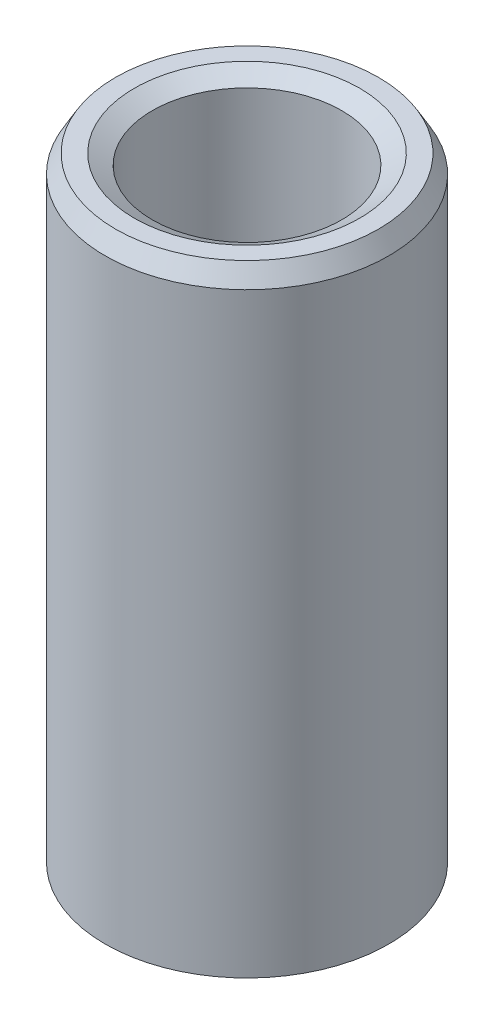
ISO-10303-21;
HEADER;
FILE_DESCRIPTION(('STEP AP214'),'2;1');
FILE_NAME('part.step','',(''),(''),'','','');
FILE_SCHEMA(('AUTOMOTIVE_DESIGN { 1 0 10303 214 1 1 1 1 }'));
ENDSEC;
DATA;
#1=APPLICATION_CONTEXT('core data for automotive mechanical design processes');
#2=APPLICATION_PROTOCOL_DEFINITION('international standard','automotive_design',2000,#1);
#3=PRODUCT_CONTEXT('',#1,'mechanical');
#4=PRODUCT('Part','Part','',(#3));
#5=PRODUCT_RELATED_PRODUCT_CATEGORY('part','',(#4));
#6=PRODUCT_DEFINITION_FORMATION('','',#4);
#7=PRODUCT_DEFINITION_CONTEXT('part definition',#1,'design');
#8=PRODUCT_DEFINITION('design','',#6,#7);
#9=PRODUCT_DEFINITION_SHAPE('','',#8);
#10=(LENGTH_UNIT() NAMED_UNIT(*) SI_UNIT(.MILLI.,.METRE.));
#11=(NAMED_UNIT(*) PLANE_ANGLE_UNIT() SI_UNIT($,.RADIAN.));
#12=(NAMED_UNIT(*) SI_UNIT($,.STERADIAN.) SOLID_ANGLE_UNIT());
#13=UNCERTAINTY_MEASURE_WITH_UNIT(LENGTH_MEASURE(1.E-05),#10,'distance_accuracy_value','');
#14=(GEOMETRIC_REPRESENTATION_CONTEXT(3) GLOBAL_UNCERTAINTY_ASSIGNED_CONTEXT((#13)) GLOBAL_UNIT_ASSIGNED_CONTEXT((#10,
#11,#12)) REPRESENTATION_CONTEXT('',''));
#15=CARTESIAN_POINT('',(0.,0.,0.));
#16=DIRECTION('',(0.,0.,1.));
#17=DIRECTION('',(1.,0.,0.));
#18=AXIS2_PLACEMENT_3D('',#15,#16,#17);
#19=CARTESIAN_POINT('',(0.,121.051964790305,0.));
#20=DIRECTION('',(0.,-1.,0.));
#21=DIRECTION('',(0.,0.,-1.));
#22=AXIS2_PLACEMENT_3D('',#19,#20,#21);
#23=CYLINDRICAL_SURFACE('',#22,27.5);
#24=CARTESIAN_POINT('',(0.,2.00933754043468,0.));
#25=DIRECTION('',(0.,1.,0.));
#26=DIRECTION('',(0.,0.,1.));
#27=AXIS2_PLACEMENT_3D('',#24,#25,#26);
#28=CIRCLE('',#27,27.5);
#29=CARTESIAN_POINT('',(0.,2.00933754043468,-27.5));
#30=VERTEX_POINT('',#29);
#31=EDGE_CURVE('E10',#30,#30,#28,.T.);
#32=CARTESIAN_POINT('',(0.,117.571690080717,0.));
#33=DIRECTION('',(0.,1.,0.));
#34=DIRECTION('',(0.,0.,1.));
#35=AXIS2_PLACEMENT_3D('',#32,#33,#34);
#36=CIRCLE('',#35,27.5);
#37=CARTESIAN_POINT('',(0.,117.571690080717,-27.5));
#38=VERTEX_POINT('',#37);
#39=EDGE_CURVE('E50',#38,#38,#36,.F.);
#40=CARTESIAN_POINT('',(0.,2.00933754043468,-27.5));
#41=CARTESIAN_POINT('',(0.,3.21311204606262,-27.5));
#42=CARTESIAN_POINT('',(0.,4.41688655169056,-27.5));
#43=CARTESIAN_POINT('',(0.,6.82443556294643,-27.5));
#44=CARTESIAN_POINT('',(0.,8.02821006857437,-27.5));
#45=CARTESIAN_POINT('',(0.,10.4357590798302,-27.5));
#46=CARTESIAN_POINT('',(0.,11.6395335854582,-27.5));
#47=CARTESIAN_POINT('',(0.,14.0470825967141,-27.5));
#48=CARTESIAN_POINT('',(0.,15.250857102342,-27.5));
#49=CARTESIAN_POINT('',(0.,17.6584061135979,-27.5));
#50=CARTESIAN_POINT('',(0.,18.8621806192258,-27.5));
#51=CARTESIAN_POINT('',(0.,21.2697296304817,-27.5));
#52=CARTESIAN_POINT('',(0.,22.4735041361096,-27.5));
#53=CARTESIAN_POINT('',(0.,24.8810531473655,-27.5));
#54=CARTESIAN_POINT('',(0.,26.0848276529934,-27.5));
#55=CARTESIAN_POINT('',(0.,28.4923766642493,-27.5));
#56=CARTESIAN_POINT('',(0.,29.6961511698773,-27.5));
#57=CARTESIAN_POINT('',(0.,32.1037001811331,-27.5));
#58=CARTESIAN_POINT('',(0.,33.3074746867611,-27.5));
#59=CARTESIAN_POINT('',(0.,35.715023698017,-27.5));
#60=CARTESIAN_POINT('',(0.,36.9187982036449,-27.5));
#61=CARTESIAN_POINT('',(0.,39.3263472149008,-27.5));
#62=CARTESIAN_POINT('',(0.,40.5301217205287,-27.5));
#63=CARTESIAN_POINT('',(0.,42.9376707317846,-27.5));
#64=CARTESIAN_POINT('',(0.,44.1414452374125,-27.5));
#65=CARTESIAN_POINT('',(0.,46.5489942486684,-27.5));
#66=CARTESIAN_POINT('',(0.,47.7527687542963,-27.5));
#67=CARTESIAN_POINT('',(0.,50.1603177655522,-27.5));
#68=CARTESIAN_POINT('',(0.,51.3640922711802,-27.5));
#69=CARTESIAN_POINT('',(0.,53.771641282436,-27.5));
#70=CARTESIAN_POINT('',(0.,54.975415788064,-27.5));
#71=CARTESIAN_POINT('',(0.,57.3829647993198,-27.5));
#72=CARTESIAN_POINT('',(0.,58.5867393049478,-27.5));
#73=CARTESIAN_POINT('',(0.,60.9942883162036,-27.5));
#74=CARTESIAN_POINT('',(0.,62.1980628218316,-27.5));
#75=CARTESIAN_POINT('',(0.,64.6056118330875,-27.5));
#76=CARTESIAN_POINT('',(0.,65.8093863387154,-27.5));
#77=CARTESIAN_POINT('',(0.,68.2169353499713,-27.5));
#78=CARTESIAN_POINT('',(0.,69.4207098555992,-27.5));
#79=CARTESIAN_POINT('',(0.,71.8282588668551,-27.5));
#80=CARTESIAN_POINT('',(0.,73.032033372483,-27.5));
#81=CARTESIAN_POINT('',(0.,75.4395823837389,-27.5));
#82=CARTESIAN_POINT('',(0.,76.6433568893668,-27.5));
#83=CARTESIAN_POINT('',(0.,79.0509059006227,-27.5));
#84=CARTESIAN_POINT('',(0.,80.2546804062507,-27.5));
#85=CARTESIAN_POINT('',(0.,82.6622294175065,-27.5));
#86=CARTESIAN_POINT('',(0.,83.8660039231345,-27.5));
#87=CARTESIAN_POINT('',(0.,86.2735529343903,-27.5));
#88=CARTESIAN_POINT('',(0.,87.4773274400183,-27.5));
#89=CARTESIAN_POINT('',(0.,89.8848764512742,-27.5));
#90=CARTESIAN_POINT('',(0.,91.0886509569021,-27.5));
#91=CARTESIAN_POINT('',(0.,93.496199968158,-27.5));
#92=CARTESIAN_POINT('',(0.,94.6999744737859,-27.5));
#93=CARTESIAN_POINT('',(0.,97.1075234850418,-27.5));
#94=CARTESIAN_POINT('',(0.,98.3112979906697,-27.5));
#95=CARTESIAN_POINT('',(0.,100.718847001926,-27.5));
#96=CARTESIAN_POINT('',(0.,101.922621507554,-27.5));
#97=CARTESIAN_POINT('',(0.,104.330170518809,-27.5));
#98=CARTESIAN_POINT('',(0.,105.533945024437,-27.5));
#99=CARTESIAN_POINT('',(0.,107.941494035693,-27.5));
#100=CARTESIAN_POINT('',(0.,109.145268541321,-27.5));
#101=CARTESIAN_POINT('',(0.,111.552817552577,-27.5));
#102=CARTESIAN_POINT('',(0.,112.756592058205,-27.5));
#103=CARTESIAN_POINT('',(0.,115.164141069461,-27.5));
#104=CARTESIAN_POINT('',(0.,116.367915575089,-27.5));
#105=CARTESIAN_POINT('',(0.,117.571690080717,-27.5));
#106=B_SPLINE_CURVE_WITH_KNOTS('',3,(#40,#41,#42,#43,#44,#45,#46,#47,#48,#49,#50,#51,#52,#53,
#54,#55,#56,#57,#58,#59,#60,#61,#62,#63,#64,#65,#66,#67,#68,#69,#70,#71,#72,#73,#74,#75,#76,#77,
#78,#79,#80,#81,#82,#83,#84,#85,#86,#87,#88,#89,#90,#91,#92,#93,#94,#95,#96,#97,#98,#99,#100,
#101,#102,#103,#104,#105),.UNSPECIFIED.,.F.,.F.,(4,2,2,2,2,2,2,2,2,2,2,2,2,2,2,2,2,2,2,2,2,2,2,
2,2,2,2,2,2,2,2,2,4),(0.,3.61132351688381,7.22264703376763,10.8339705506514,14.4452940675353,
18.0566175844191,21.6679411013029,25.2792646181867,28.8905881350705,32.5019116519543,
36.1132351688381,39.724558685722,43.3358822026058,46.9472057194896,50.5585292363734,
54.1698527532572,57.781176270141,61.3924997870248,65.0038233039086,68.6151468207925,
72.2264703376763,75.8377938545601,79.4491173714439,83.0604408883277,86.6717644052115,
90.2830879220953,93.8944114389792,97.505734955863,101.117058472747,104.728381989631,
108.339705506514,111.951029023398,115.562352540282),.UNSPECIFIED.);
#107=EDGE_CURVE('BSEAM39',#30,#38,#106,.T.);
#108=ORIENTED_EDGE('',*,*,#31,.T.);
#109=ORIENTED_EDGE('',*,*,#39,.T.);
#110=ORIENTED_EDGE('',*,*,#107,.T.);
#111=ORIENTED_EDGE('',*,*,#107,.F.);
#112=EDGE_LOOP('',(#108,#110,#109,#111));
#113=FACE_BOUND('',#112,.T.);
#114=ADVANCED_FACE('F39',(#113),#23,.T.);
#115=CARTESIAN_POINT('',(0.,121.051964790305,0.));
#116=DIRECTION('',(0.,1.,0.));
#117=DIRECTION('',(0.,0.,1.));
#118=AXIS2_PLACEMENT_3D('',#115,#116,#117);
#119=PLANE('',#118);
#120=CARTESIAN_POINT('',(0.,121.051964790305,0.));
#121=DIRECTION('',(0.,1.,0.));
#122=DIRECTION('',(0.,0.,1.));
#123=AXIS2_PLACEMENT_3D('',#120,#121,#122);
#124=CIRCLE('',#123,21.8428901434099);
#125=CARTESIAN_POINT('',(0.,121.051964790305,21.8428901434099));
#126=VERTEX_POINT('',#125);
#127=EDGE_CURVE('E58',#126,#126,#124,.F.);
#128=ORIENTED_EDGE('',*,*,#127,.T.);
#129=EDGE_LOOP('',(#128));
#130=FACE_BOUND('',#129,.T.);
#131=CARTESIAN_POINT('',(0.,121.051964790305,0.));
#132=DIRECTION('',(0.,1.,0.));
#133=DIRECTION('',(0.,0.,1.));
#134=AXIS2_PLACEMENT_3D('',#131,#132,#133);
#135=CIRCLE('',#134,25.4906624595654);
#136=CARTESIAN_POINT('',(0.,121.051964790305,25.4906624595654));
#137=VERTEX_POINT('',#136);
#138=EDGE_CURVE('E61',#137,#137,#135,.T.);
#139=ORIENTED_EDGE('',*,*,#138,.T.);
#140=EDGE_LOOP('',(#139));
#141=FACE_BOUND('',#140,.T.);
#142=ADVANCED_FACE('F88',(#130,#141),#119,.T.);
#143=CARTESIAN_POINT('',(0.,0.,0.));
#144=DIRECTION('',(0.,1.,0.));
#145=DIRECTION('',(0.,0.,1.));
#146=AXIS2_PLACEMENT_3D('',#143,#144,#145);
#147=PLANE('',#146);
#148=CARTESIAN_POINT('',(0.,0.,0.));
#149=DIRECTION('',(0.,1.,0.));
#150=DIRECTION('',(0.,0.,1.));
#151=AXIS2_PLACEMENT_3D('',#148,#149,#150);
#152=CIRCLE('',#151,20.3719529742561);
#153=CARTESIAN_POINT('',(0.,0.,20.3719529742561));
#154=VERTEX_POINT('',#153);
#155=EDGE_CURVE('E51',#154,#154,#152,.T.);
#156=ORIENTED_EDGE('',*,*,#155,.T.);
#157=EDGE_LOOP('',(#156));
#158=FACE_BOUND('',#157,.T.);
#159=CARTESIAN_POINT('',(0.,0.,0.));
#160=DIRECTION('',(0.,1.,0.));
#161=DIRECTION('',(0.,0.,1.));
#162=AXIS2_PLACEMENT_3D('',#159,#160,#161);
#163=CIRCLE('',#162,24.0197252904116);
#164=CARTESIAN_POINT('',(0.,0.,24.0197252904116));
#165=VERTEX_POINT('',#164);
#166=EDGE_CURVE('E54',#165,#165,#163,.F.);
#167=ORIENTED_EDGE('',*,*,#166,.T.);
#168=EDGE_LOOP('',(#167));
#169=FACE_BOUND('',#168,.T.);
#170=ADVANCED_FACE('F83',(#158,#169),#147,.F.);
#171=CARTESIAN_POINT('',(0.,121.051964790305,0.));
#172=DIRECTION('',(0.,-1.,0.));
#173=DIRECTION('',(0.,0.,-1.));
#174=AXIS2_PLACEMENT_3D('',#171,#172,#173);
#175=CYLINDRICAL_SURFACE('',#174,18.3626154338215);
#176=CARTESIAN_POINT('',(0.,119.04262724987,0.));
#177=DIRECTION('',(0.,1.,0.));
#178=DIRECTION('',(0.,0.,1.));
#179=AXIS2_PLACEMENT_3D('',#176,#177,#178);
#180=CIRCLE('',#179,18.3626154338215);
#181=CARTESIAN_POINT('',(0.,119.04262724987,-18.3626154338215));
#182=VERTEX_POINT('',#181);
#183=EDGE_CURVE('E67',#182,#182,#180,.T.);
#184=CARTESIAN_POINT('',(0.,3.48027470958831,0.));
#185=DIRECTION('',(0.,1.,0.));
#186=DIRECTION('',(0.,0.,1.));
#187=AXIS2_PLACEMENT_3D('',#184,#185,#186);
#188=CIRCLE('',#187,18.3626154338215);
#189=CARTESIAN_POINT('',(0.,3.4802747095883,-18.3626154338215));
#190=VERTEX_POINT('',#189);
#191=EDGE_CURVE('E69',#190,#190,#188,.F.);
#192=CARTESIAN_POINT('',(0.,119.04262724987,-18.3626154338215));
#193=CARTESIAN_POINT('',(0.,117.838852744242,-18.3626154338215));
#194=CARTESIAN_POINT('',(0.,116.635078238614,-18.3626154338215));
#195=CARTESIAN_POINT('',(0.,114.227529227359,-18.3626154338215));
#196=CARTESIAN_POINT('',(0.,113.023754721731,-18.3626154338215));
#197=CARTESIAN_POINT('',(0.,110.616205710475,-18.3626154338215));
#198=CARTESIAN_POINT('',(0.,109.412431204847,-18.3626154338215));
#199=CARTESIAN_POINT('',(0.,107.004882193591,-18.3626154338215));
#200=CARTESIAN_POINT('',(0.,105.801107687963,-18.3626154338215));
#201=CARTESIAN_POINT('',(0.,103.393558676707,-18.3626154338215));
#202=CARTESIAN_POINT('',(0.,102.189784171079,-18.3626154338215));
#203=CARTESIAN_POINT('',(0.,99.7822351598232,-18.3626154338215));
#204=CARTESIAN_POINT('',(0.,98.5784606541953,-18.3626154338215));
#205=CARTESIAN_POINT('',(0.,96.1709116429394,-18.3626154338215));
#206=CARTESIAN_POINT('',(0.,94.9671371373115,-18.3626154338215));
#207=CARTESIAN_POINT('',(0.,92.5595881260556,-18.3626154338215));
#208=CARTESIAN_POINT('',(0.,91.3558136204277,-18.3626154338215));
#209=CARTESIAN_POINT('',(0.,88.9482646091718,-18.3626154338215));
#210=CARTESIAN_POINT('',(0.,87.7444901035439,-18.3626154338215));
#211=CARTESIAN_POINT('',(0.,85.336941092288,-18.3626154338215));
#212=CARTESIAN_POINT('',(0.,84.1331665866601,-18.3626154338215));
#213=CARTESIAN_POINT('',(0.,81.7256175754042,-18.3626154338215));
#214=CARTESIAN_POINT('',(0.,80.5218430697763,-18.3626154338215));
#215=CARTESIAN_POINT('',(0.,78.1142940585204,-18.3626154338215));
#216=CARTESIAN_POINT('',(0.,76.9105195528925,-18.3626154338215));
#217=CARTESIAN_POINT('',(0.,74.5029705416366,-18.3626154338215));
#218=CARTESIAN_POINT('',(0.,73.2991960360086,-18.3626154338215));
#219=CARTESIAN_POINT('',(0.,70.8916470247528,-18.3626154338215));
#220=CARTESIAN_POINT('',(0.,69.6878725191248,-18.3626154338215));
#221=CARTESIAN_POINT('',(0.,67.280323507869,-18.3626154338215));
#222=CARTESIAN_POINT('',(0.,66.076549002241,-18.3626154338215));
#223=CARTESIAN_POINT('',(0.,63.6689999909851,-18.3626154338215));
#224=CARTESIAN_POINT('',(0.,62.4652254853572,-18.3626154338215));
#225=CARTESIAN_POINT('',(0.,60.0576764741013,-18.3626154338215));
#226=CARTESIAN_POINT('',(0.,58.8539019684734,-18.3626154338215));
#227=CARTESIAN_POINT('',(0.,56.4463529572175,-18.3626154338215));
#228=CARTESIAN_POINT('',(0.,55.2425784515896,-18.3626154338215));
#229=CARTESIAN_POINT('',(0.,52.8350294403337,-18.3626154338215));
#230=CARTESIAN_POINT('',(0.,51.6312549347058,-18.3626154338215));
#231=CARTESIAN_POINT('',(0.,49.2237059234499,-18.3626154338215));
#232=CARTESIAN_POINT('',(0.,48.019931417822,-18.3626154338215));
#233=CARTESIAN_POINT('',(0.,45.6123824065661,-18.3626154338215));
#234=CARTESIAN_POINT('',(0.,44.4086079009382,-18.3626154338215));
#235=CARTESIAN_POINT('',(0.,42.0010588896823,-18.3626154338215));
#236=CARTESIAN_POINT('',(0.,40.7972843840543,-18.3626154338215));
#237=CARTESIAN_POINT('',(0.,38.3897353727985,-18.3626154338215));
#238=CARTESIAN_POINT('',(0.,37.1859608671705,-18.3626154338215));
#239=CARTESIAN_POINT('',(0.,34.7784118559147,-18.3626154338215));
#240=CARTESIAN_POINT('',(0.,33.5746373502867,-18.3626154338215));
#241=CARTESIAN_POINT('',(0.,31.1670883390309,-18.3626154338215));
#242=CARTESIAN_POINT('',(0.,29.9633138334029,-18.3626154338215));
#243=CARTESIAN_POINT('',(0.,27.555764822147,-18.3626154338215));
#244=CARTESIAN_POINT('',(0.,26.3519903165191,-18.3626154338215));
#245=CARTESIAN_POINT('',(0.,23.9444413052632,-18.3626154338215));
#246=CARTESIAN_POINT('',(0.,22.7406667996353,-18.3626154338215));
#247=CARTESIAN_POINT('',(0.,20.3331177883794,-18.3626154338215));
#248=CARTESIAN_POINT('',(0.,19.1293432827515,-18.3626154338215));
#249=CARTESIAN_POINT('',(0.,16.7217942714956,-18.3626154338215));
#250=CARTESIAN_POINT('',(0.,15.5180197658677,-18.3626154338215));
#251=CARTESIAN_POINT('',(0.,13.1104707546118,-18.3626154338215));
#252=CARTESIAN_POINT('',(0.,11.9066962489839,-18.3626154338215));
#253=CARTESIAN_POINT('',(0.,9.49914723772799,-18.3626154338215));
#254=CARTESIAN_POINT('',(0.,8.29537273210005,-18.3626154338215));
#255=CARTESIAN_POINT('',(0.,5.88782372084417,-18.3626154338215));
#256=CARTESIAN_POINT('',(0.,4.68404921521623,-18.3626154338215));
#257=CARTESIAN_POINT('',(0.,3.4802747095883,-18.3626154338215));
#258=B_SPLINE_CURVE_WITH_KNOTS('',3,(#192,#193,#194,#195,#196,#197,#198,#199,#200,#201,#202,
#203,#204,#205,#206,#207,#208,#209,#210,#211,#212,#213,#214,#215,#216,#217,#218,#219,#220,#221,
#222,#223,#224,#225,#226,#227,#228,#229,#230,#231,#232,#233,#234,#235,#236,#237,#238,#239,#240,
#241,#242,#243,#244,#245,#246,#247,#248,#249,#250,#251,#252,#253,#254,#255,#256,#257),
.UNSPECIFIED.,.F.,.F.,(4,2,2,2,2,2,2,2,2,2,2,2,2,2,2,2,2,2,2,2,2,2,2,2,2,2,2,2,2,2,2,2,4),(0.,
3.6113235168838,7.22264703376761,10.8339705506514,14.4452940675352,18.0566175844191,
21.6679411013029,25.2792646181867,28.8905881350705,32.5019116519543,36.1132351688381,
39.7245586857219,43.3358822026057,46.9472057194895,50.5585292363733,54.1698527532572,
57.781176270141,61.3924997870248,65.0038233039086,68.6151468207924,72.2264703376762,
75.83779385456,79.4491173714438,83.0604408883276,86.6717644052114,90.2830879220953,
93.8944114389791,97.5057349558629,101.117058472747,104.72838198963,108.339705506514,
111.951029023398,115.562352540282),.UNSPECIFIED.);
#259=EDGE_CURVE('BSEAM71',#182,#190,#258,.T.);
#260=ORIENTED_EDGE('',*,*,#183,.T.);
#261=ORIENTED_EDGE('',*,*,#191,.T.);
#262=ORIENTED_EDGE('',*,*,#259,.T.);
#263=ORIENTED_EDGE('',*,*,#259,.F.);
#264=EDGE_LOOP('',(#260,#262,#261,#263));
#265=FACE_BOUND('',#264,.T.);
#266=ADVANCED_FACE('F71',(#265),#175,.F.);
#267=CARTESIAN_POINT('',(0.,119.04262724987,0.));
#268=DIRECTION('',(0.,1.,0.));
#269=DIRECTION('',(0.,0.,1.));
#270=AXIS2_PLACEMENT_3D('',#267,#268,#269);
#271=CONICAL_SURFACE('',#270,18.3626154338215,1.0471975511966);
#272=ORIENTED_EDGE('',*,*,#127,.F.);
#273=EDGE_LOOP('',(#272));
#274=FACE_BOUND('',#273,.T.);
#275=ORIENTED_EDGE('',*,*,#183,.F.);
#276=EDGE_LOOP('',(#275));
#277=FACE_BOUND('',#276,.T.);
#278=ADVANCED_FACE('F77',(#274,#277),#271,.F.);
#279=CARTESIAN_POINT('',(0.,0.,0.));
#280=DIRECTION('',(0.,-1.,0.));
#281=DIRECTION('',(0.,0.,-1.));
#282=AXIS2_PLACEMENT_3D('',#279,#280,#281);
#283=CONICAL_SURFACE('',#282,20.3719529742561,0.523598775598296);
#284=ORIENTED_EDGE('',*,*,#191,.F.);
#285=EDGE_LOOP('',(#284));
#286=FACE_BOUND('',#285,.T.);
#287=ORIENTED_EDGE('',*,*,#155,.F.);
#288=EDGE_LOOP('',(#287));
#289=FACE_BOUND('',#288,.T.);
#290=ADVANCED_FACE('F73',(#286,#289),#283,.F.);
#291=CARTESIAN_POINT('',(0.,2.00933754043468,0.));
#292=DIRECTION('',(0.,1.,0.));
#293=DIRECTION('',(0.,0.,1.));
#294=AXIS2_PLACEMENT_3D('',#291,#292,#293);
#295=CONICAL_SURFACE('',#294,27.5,1.0471975511966);
#296=ORIENTED_EDGE('',*,*,#166,.F.);
#297=EDGE_LOOP('',(#296));
#298=FACE_BOUND('',#297,.T.);
#299=ORIENTED_EDGE('',*,*,#31,.F.);
#300=EDGE_LOOP('',(#299));
#301=FACE_BOUND('',#300,.T.);
#302=ADVANCED_FACE('F76',(#298,#301),#295,.T.);
#303=CARTESIAN_POINT('',(0.,121.051964790305,0.));
#304=DIRECTION('',(0.,-1.,0.));
#305=DIRECTION('',(0.,0.,-1.));
#306=AXIS2_PLACEMENT_3D('',#303,#304,#305);
#307=CONICAL_SURFACE('',#306,25.4906624595654,0.523598775598296);
#308=ORIENTED_EDGE('',*,*,#39,.F.);
#309=EDGE_LOOP('',(#308));
#310=FACE_BOUND('',#309,.T.);
#311=ORIENTED_EDGE('',*,*,#138,.F.);
#312=EDGE_LOOP('',(#311));
#313=FACE_BOUND('',#312,.T.);
#314=ADVANCED_FACE('F45',(#310,#313),#307,.T.);
#315=CLOSED_SHELL('',(#114,#142,#170,#266,#278,#290,#302,#314));
#316=MANIFOLD_SOLID_BREP('B2',#315);
#317=ADVANCED_BREP_SHAPE_REPRESENTATION('',(#18,#316),#14);
#318=SHAPE_DEFINITION_REPRESENTATION(#9,#317);
ENDSEC;
END-ISO-10303-21;
